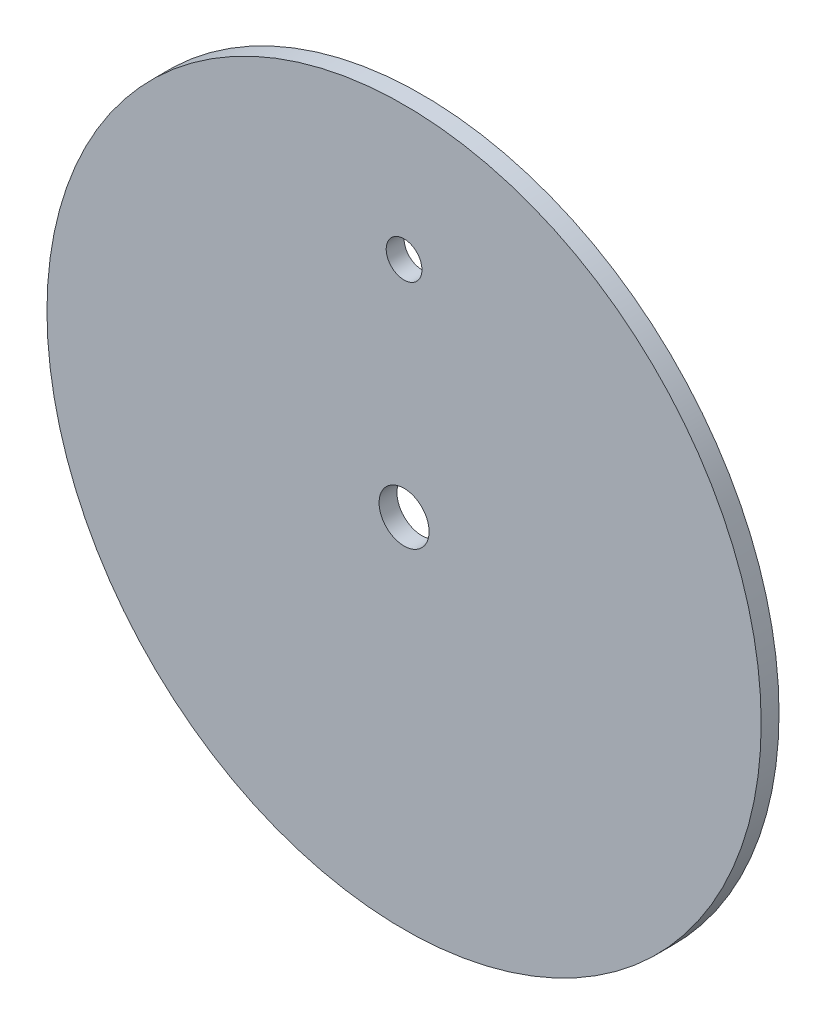
ISO-10303-21;
HEADER;
FILE_DESCRIPTION(('STEP AP214'),'2;1');
FILE_NAME('part.step','',(''),(''),'','','');
FILE_SCHEMA(('AUTOMOTIVE_DESIGN { 1 0 10303 214 1 1 1 1 }'));
ENDSEC;
DATA;
#1=APPLICATION_CONTEXT('core data for automotive mechanical design processes');
#2=APPLICATION_PROTOCOL_DEFINITION('international standard','automotive_design',2000,#1);
#3=PRODUCT_CONTEXT('',#1,'mechanical');
#4=PRODUCT('Part','Part','',(#3));
#5=PRODUCT_RELATED_PRODUCT_CATEGORY('part','',(#4));
#6=PRODUCT_DEFINITION_FORMATION('','',#4);
#7=PRODUCT_DEFINITION_CONTEXT('part definition',#1,'design');
#8=PRODUCT_DEFINITION('design','',#6,#7);
#9=PRODUCT_DEFINITION_SHAPE('','',#8);
#10=(LENGTH_UNIT() NAMED_UNIT(*) SI_UNIT(.MILLI.,.METRE.));
#11=(NAMED_UNIT(*) PLANE_ANGLE_UNIT() SI_UNIT($,.RADIAN.));
#12=(NAMED_UNIT(*) SI_UNIT($,.STERADIAN.) SOLID_ANGLE_UNIT());
#13=UNCERTAINTY_MEASURE_WITH_UNIT(LENGTH_MEASURE(1.E-05),#10,'distance_accuracy_value','');
#14=(GEOMETRIC_REPRESENTATION_CONTEXT(3) GLOBAL_UNCERTAINTY_ASSIGNED_CONTEXT((#13)) GLOBAL_UNIT_ASSIGNED_CONTEXT((#10,
#11,#12)) REPRESENTATION_CONTEXT('',''));
#15=CARTESIAN_POINT('',(0.,0.,0.));
#16=DIRECTION('',(0.,0.,1.));
#17=DIRECTION('',(1.,0.,0.));
#18=AXIS2_PLACEMENT_3D('',#15,#16,#17);
#19=CARTESIAN_POINT('',(45.2059904079134,-15.7615616000238,-1.));
#20=DIRECTION('',(0.,0.,1.));
#21=DIRECTION('',(1.,0.,0.));
#22=AXIS2_PLACEMENT_3D('',#19,#20,#21);
#23=CYLINDRICAL_SURFACE('',#22,20.);
#24=CARTESIAN_POINT('',(45.2059904079134,-15.7615616000238,-1.));
#25=DIRECTION('',(0.,0.,1.));
#26=DIRECTION('',(1.,0.,0.));
#27=AXIS2_PLACEMENT_3D('',#24,#25,#26);
#28=CIRCLE('',#27,20.);
#29=CARTESIAN_POINT('',(65.2059904079134,-15.7615616000238,-1.));
#30=VERTEX_POINT('',#29);
#31=EDGE_CURVE('E10',#30,#30,#28,.T.);
#32=ORIENTED_EDGE('',*,*,#31,.T.);
#33=EDGE_LOOP('',(#32));
#34=FACE_BOUND('',#33,.T.);
#35=CARTESIAN_POINT('',(45.2059904079134,-15.7615616000238,0.));
#36=DIRECTION('',(0.,0.,1.));
#37=DIRECTION('',(1.,0.,0.));
#38=AXIS2_PLACEMENT_3D('',#35,#36,#37);
#39=CIRCLE('',#38,20.);
#40=CARTESIAN_POINT('',(65.2059904079134,-15.7615616000238,0.));
#41=VERTEX_POINT('',#40);
#42=EDGE_CURVE('E40',#41,#41,#39,.T.);
#43=ORIENTED_EDGE('',*,*,#42,.F.);
#44=EDGE_LOOP('',(#43));
#45=FACE_BOUND('',#44,.T.);
#46=ADVANCED_FACE('F37',(#34,#45),#23,.T.);
#47=CARTESIAN_POINT('',(45.2059904079134,-15.7615616000238,-1.));
#48=DIRECTION('',(0.,0.,1.));
#49=DIRECTION('',(1.,0.,0.));
#50=AXIS2_PLACEMENT_3D('',#47,#48,#49);
#51=PLANE('',#50);
#52=CARTESIAN_POINT('',(45.2059904079134,-3.26156160002383,-1.));
#53=DIRECTION('',(0.,0.,1.));
#54=DIRECTION('',(1.,0.,0.));
#55=AXIS2_PLACEMENT_3D('',#52,#53,#54);
#56=CIRCLE('',#55,0.9999999999584);
#57=CARTESIAN_POINT('',(46.2059904078718,-3.26156160002383,-1.));
#58=VERTEX_POINT('',#57);
#59=EDGE_CURVE('E52',#58,#58,#56,.T.);
#60=ORIENTED_EDGE('',*,*,#59,.T.);
#61=EDGE_LOOP('',(#60));
#62=FACE_BOUND('',#61,.T.);
#63=CARTESIAN_POINT('',(45.2059904079134,-15.7615616000238,-1.));
#64=DIRECTION('',(0.,0.,1.));
#65=DIRECTION('',(1.,0.,0.));
#66=AXIS2_PLACEMENT_3D('',#63,#64,#65);
#67=CIRCLE('',#66,1.3999999999584);
#68=CARTESIAN_POINT('',(46.6059904078718,-15.7615616000238,-1.));
#69=VERTEX_POINT('',#68);
#70=EDGE_CURVE('E47',#69,#69,#67,.T.);
#71=ORIENTED_EDGE('',*,*,#70,.T.);
#72=EDGE_LOOP('',(#71));
#73=FACE_BOUND('',#72,.T.);
#74=ORIENTED_EDGE('',*,*,#31,.F.);
#75=EDGE_LOOP('',(#74));
#76=FACE_BOUND('',#75,.T.);
#77=ADVANCED_FACE('F61',(#62,#73,#76),#51,.F.);
#78=CARTESIAN_POINT('',(45.2059904079134,-15.7615616000238,0.));
#79=DIRECTION('',(0.,0.,1.));
#80=DIRECTION('',(1.,0.,0.));
#81=AXIS2_PLACEMENT_3D('',#78,#79,#80);
#82=PLANE('',#81);
#83=CARTESIAN_POINT('',(45.2059904079134,-3.26156160002383,0.));
#84=DIRECTION('',(0.,0.,1.));
#85=DIRECTION('',(1.,0.,0.));
#86=AXIS2_PLACEMENT_3D('',#83,#84,#85);
#87=CIRCLE('',#86,0.9999999999584);
#88=CARTESIAN_POINT('',(46.2059904078718,-3.26156160002383,0.));
#89=VERTEX_POINT('',#88);
#90=EDGE_CURVE('E55',#89,#89,#87,.T.);
#91=ORIENTED_EDGE('',*,*,#90,.F.);
#92=EDGE_LOOP('',(#91));
#93=FACE_BOUND('',#92,.T.);
#94=CARTESIAN_POINT('',(45.2059904079134,-15.7615616000238,0.));
#95=DIRECTION('',(0.,0.,1.));
#96=DIRECTION('',(1.,0.,0.));
#97=AXIS2_PLACEMENT_3D('',#94,#95,#96);
#98=CIRCLE('',#97,1.3999999999584);
#99=CARTESIAN_POINT('',(46.6059904078718,-15.7615616000238,0.));
#100=VERTEX_POINT('',#99);
#101=EDGE_CURVE('E49',#100,#100,#98,.T.);
#102=ORIENTED_EDGE('',*,*,#101,.F.);
#103=EDGE_LOOP('',(#102));
#104=FACE_BOUND('',#103,.T.);
#105=ORIENTED_EDGE('',*,*,#42,.T.);
#106=EDGE_LOOP('',(#105));
#107=FACE_BOUND('',#106,.T.);
#108=ADVANCED_FACE('F71',(#93,#104,#107),#82,.T.);
#109=CARTESIAN_POINT('',(45.2059904079134,-15.7615616000238,-1.));
#110=DIRECTION('',(0.,0.,1.));
#111=DIRECTION('',(1.,0.,0.));
#112=AXIS2_PLACEMENT_3D('',#109,#110,#111);
#113=CYLINDRICAL_SURFACE('',#112,1.3999999999584);
#114=ORIENTED_EDGE('',*,*,#70,.F.);
#115=EDGE_LOOP('',(#114));
#116=FACE_BOUND('',#115,.T.);
#117=ORIENTED_EDGE('',*,*,#101,.T.);
#118=EDGE_LOOP('',(#117));
#119=FACE_BOUND('',#118,.T.);
#120=ADVANCED_FACE('F67',(#116,#119),#113,.F.);
#121=CARTESIAN_POINT('',(45.2059904079134,-3.26156160002383,-1.));
#122=DIRECTION('',(0.,0.,1.));
#123=DIRECTION('',(1.,0.,0.));
#124=AXIS2_PLACEMENT_3D('',#121,#122,#123);
#125=CYLINDRICAL_SURFACE('',#124,0.9999999999584);
#126=ORIENTED_EDGE('',*,*,#59,.F.);
#127=EDGE_LOOP('',(#126));
#128=FACE_BOUND('',#127,.T.);
#129=ORIENTED_EDGE('',*,*,#90,.T.);
#130=EDGE_LOOP('',(#129));
#131=FACE_BOUND('',#130,.T.);
#132=ADVANCED_FACE('F64',(#128,#131),#125,.F.);
#133=CLOSED_SHELL('',(#46,#77,#108,#120,#132));
#134=MANIFOLD_SOLID_BREP('B2',#133);
#135=ADVANCED_BREP_SHAPE_REPRESENTATION('',(#18,#134),#14);
#136=SHAPE_DEFINITION_REPRESENTATION(#9,#135);
ENDSEC;
END-ISO-10303-21;
